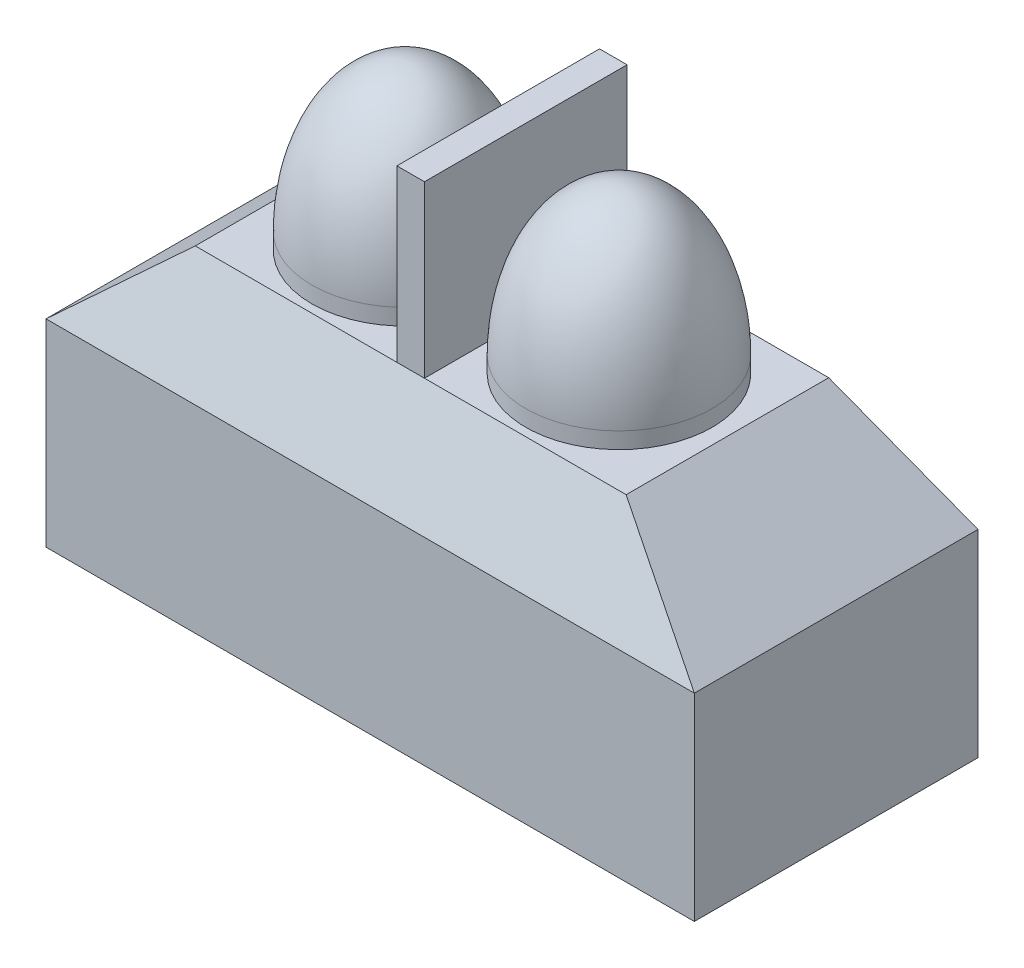
ISO-10303-21;
HEADER;
FILE_DESCRIPTION(('STEP AP214'),'2;1');
FILE_NAME('part.step','',(''),(''),'','','');
FILE_SCHEMA(('AUTOMOTIVE_DESIGN { 1 0 10303 214 1 1 1 1 }'));
ENDSEC;
DATA;
#1=APPLICATION_CONTEXT('core data for automotive mechanical design processes');
#2=APPLICATION_PROTOCOL_DEFINITION('international standard','automotive_design',2000,#1);
#3=PRODUCT_CONTEXT('',#1,'mechanical');
#4=PRODUCT('Part','Part','',(#3));
#5=PRODUCT_RELATED_PRODUCT_CATEGORY('part','',(#4));
#6=PRODUCT_DEFINITION_FORMATION('','',#4);
#7=PRODUCT_DEFINITION_CONTEXT('part definition',#1,'design');
#8=PRODUCT_DEFINITION('design','',#6,#7);
#9=PRODUCT_DEFINITION_SHAPE('','',#8);
#10=(LENGTH_UNIT() NAMED_UNIT(*) SI_UNIT(.MILLI.,.METRE.));
#11=(NAMED_UNIT(*) PLANE_ANGLE_UNIT() SI_UNIT($,.RADIAN.));
#12=(NAMED_UNIT(*) SI_UNIT($,.STERADIAN.) SOLID_ANGLE_UNIT());
#13=UNCERTAINTY_MEASURE_WITH_UNIT(LENGTH_MEASURE(1.E-05),#10,'distance_accuracy_value','');
#14=(GEOMETRIC_REPRESENTATION_CONTEXT(3) GLOBAL_UNCERTAINTY_ASSIGNED_CONTEXT((#13)) GLOBAL_UNIT_ASSIGNED_CONTEXT((#10,
#11,#12)) REPRESENTATION_CONTEXT('',''));
#15=CARTESIAN_POINT('',(0.,0.,0.));
#16=DIRECTION('',(0.,0.,1.));
#17=DIRECTION('',(1.,0.,0.));
#18=AXIS2_PLACEMENT_3D('',#15,#16,#17);
#19=CARTESIAN_POINT('',(1.6764,4.8768,0.));
#20=DIRECTION('',(0.,-1.,0.));
#21=DIRECTION('',(0.,0.,-1.));
#22=AXIS2_PLACEMENT_3D('',#19,#20,#21);
#23=CYLINDRICAL_SURFACE('',#22,1.4605);
#24=CARTESIAN_POINT('',(1.6764,4.8768,0.));
#25=DIRECTION('',(0.,1.,0.));
#26=DIRECTION('',(0.,0.,-1.));
#27=AXIS2_PLACEMENT_3D('',#24,#25,#26);
#28=CIRCLE('',#27,1.4605);
#29=CARTESIAN_POINT('',(1.6764,4.8768,-1.4605));
#30=VERTEX_POINT('',#29);
#31=EDGE_CURVE('E13',#30,#30,#28,.T.);
#32=ORIENTED_EDGE('',*,*,#31,.F.);
#33=EDGE_LOOP('',(#32));
#34=FACE_BOUND('',#33,.T.);
#35=CARTESIAN_POINT('',(1.6764,4.6228,0.));
#36=DIRECTION('',(0.,1.,0.));
#37=DIRECTION('',(0.,0.,-1.));
#38=AXIS2_PLACEMENT_3D('',#35,#36,#37);
#39=CIRCLE('',#38,1.4605);
#40=CARTESIAN_POINT('',(1.6764,4.6228,-1.4605));
#41=VERTEX_POINT('',#40);
#42=EDGE_CURVE('E53',#41,#41,#39,.T.);
#43=ORIENTED_EDGE('',*,*,#42,.T.);
#44=EDGE_LOOP('',(#43));
#45=FACE_BOUND('',#44,.T.);
#46=ADVANCED_FACE('F45',(#34,#45),#23,.T.);
#47=CARTESIAN_POINT('',(1.6764,4.8768,0.));
#48=DIRECTION('',(-1.,0.,0.));
#49=DIRECTION('',(0.,1.,0.));
#50=AXIS2_PLACEMENT_3D('',#47,#48,#49);
#51=ELLIPSE('',#50,2.286,1.4605);
#52=TRIMMED_CURVE('',#51,(PARAMETER_VALUE(0.)),(PARAMETER_VALUE(3.14159265358979)),.T.,.PARAMETER.);
#53=CARTESIAN_POINT('',(1.6764,2.5908,0.));
#54=DIRECTION('',(0.,1.,0.));
#55=AXIS1_PLACEMENT('',#53,#54);
#56=SURFACE_OF_REVOLUTION('',#52,#55);
#57=CARTESIAN_POINT('',(1.6764,7.1628,0.));
#58=VERTEX_POINT('',#57);
#59=VERTEX_LOOP('',#58);
#60=FACE_BOUND('',#59,.T.);
#61=ORIENTED_EDGE('',*,*,#31,.T.);
#62=EDGE_LOOP('',(#61));
#63=FACE_BOUND('',#62,.T.);
#64=ADVANCED_FACE('F47',(#60,#63),#56,.F.);
#65=CARTESIAN_POINT('',(1.6764,4.6228,0.));
#66=DIRECTION('',(0.,-1.,0.));
#67=DIRECTION('',(0.,0.,-1.));
#68=AXIS2_PLACEMENT_3D('',#65,#66,#67);
#69=PLANE('',#68);
#70=ORIENTED_EDGE('',*,*,#42,.F.);
#71=EDGE_LOOP('',(#70));
#72=FACE_BOUND('',#71,.T.);
#73=ADVANCED_FACE('F58',(#72),#69,.T.);
#74=CLOSED_SHELL('',(#46,#64,#73));
#75=MANIFOLD_SOLID_BREP('B2',#74);
#76=CARTESIAN_POINT('',(-1.6764,4.8768,0.));
#77=DIRECTION('',(0.,-1.,0.));
#78=DIRECTION('',(0.,0.,-1.));
#79=AXIS2_PLACEMENT_3D('',#76,#77,#78);
#80=CYLINDRICAL_SURFACE('',#79,1.4605);
#81=CARTESIAN_POINT('',(-1.6764,4.8768,0.));
#82=DIRECTION('',(0.,1.,0.));
#83=DIRECTION('',(0.,0.,1.));
#84=AXIS2_PLACEMENT_3D('',#81,#82,#83);
#85=CIRCLE('',#84,1.4605);
#86=CARTESIAN_POINT('',(-1.6764,4.8768,1.4605));
#87=VERTEX_POINT('',#86);
#88=EDGE_CURVE('E43',#87,#87,#85,.T.);
#89=ORIENTED_EDGE('',*,*,#88,.F.);
#90=EDGE_LOOP('',(#89));
#91=FACE_BOUND('',#90,.T.);
#92=CARTESIAN_POINT('',(-1.6764,4.6228,0.));
#93=DIRECTION('',(0.,1.,0.));
#94=DIRECTION('',(0.,0.,1.));
#95=AXIS2_PLACEMENT_3D('',#92,#93,#94);
#96=CIRCLE('',#95,1.4605);
#97=CARTESIAN_POINT('',(-1.6764,4.6228,1.4605));
#98=VERTEX_POINT('',#97);
#99=EDGE_CURVE('E107',#98,#98,#96,.T.);
#100=ORIENTED_EDGE('',*,*,#99,.T.);
#101=EDGE_LOOP('',(#100));
#102=FACE_BOUND('',#101,.T.);
#103=ADVANCED_FACE('F99',(#91,#102),#80,.T.);
#104=CARTESIAN_POINT('',(-1.6764,4.8768,0.));
#105=DIRECTION('',(1.,0.,0.));
#106=DIRECTION('',(0.,1.,0.));
#107=AXIS2_PLACEMENT_3D('',#104,#105,#106);
#108=ELLIPSE('',#107,2.286,1.4605);
#109=TRIMMED_CURVE('',#108,(PARAMETER_VALUE(0.)),(PARAMETER_VALUE(3.14159265358979)),.T.,.PARAMETER.);
#110=CARTESIAN_POINT('',(-1.6764,2.5908,0.));
#111=DIRECTION('',(0.,1.,0.));
#112=AXIS1_PLACEMENT('',#110,#111);
#113=SURFACE_OF_REVOLUTION('',#109,#112);
#114=CARTESIAN_POINT('',(-1.6764,7.1628,0.));
#115=VERTEX_POINT('',#114);
#116=VERTEX_LOOP('',#115);
#117=FACE_BOUND('',#116,.T.);
#118=ORIENTED_EDGE('',*,*,#88,.T.);
#119=EDGE_LOOP('',(#118));
#120=FACE_BOUND('',#119,.T.);
#121=ADVANCED_FACE('F101',(#117,#120),#113,.F.);
#122=CARTESIAN_POINT('',(-1.6764,4.6228,0.));
#123=DIRECTION('',(0.,1.,0.));
#124=DIRECTION('',(0.,0.,1.));
#125=AXIS2_PLACEMENT_3D('',#122,#123,#124);
#126=PLANE('',#125);
#127=ORIENTED_EDGE('',*,*,#99,.F.);
#128=EDGE_LOOP('',(#127));
#129=FACE_BOUND('',#128,.T.);
#130=ADVANCED_FACE('F112',(#129),#126,.F.);
#131=CLOSED_SHELL('',(#103,#121,#130));
#132=MANIFOLD_SOLID_BREP('B7',#131);
#133=CARTESIAN_POINT('',(5.08,4.6228,-2.2225));
#134=DIRECTION('',(0.,-1.,0.));
#135=DIRECTION('',(0.,0.,-1.));
#136=AXIS2_PLACEMENT_3D('',#133,#134,#135);
#137=PLANE('',#136);
#138=DIRECTION('',(0.,0.,-1.));
#139=VECTOR('',#138,1.);
#140=CARTESIAN_POINT('',(0.2159,4.6228,-1.5875));
#141=LINE('',#140,#139);
#142=CARTESIAN_POINT('',(0.215899999999996,4.6228,1.5875));
#143=VERTEX_POINT('',#142);
#144=CARTESIAN_POINT('',(0.215899999999996,4.6228,-1.5875));
#145=VERTEX_POINT('',#144);
#146=EDGE_CURVE('E248',#143,#145,#141,.T.);
#147=ORIENTED_EDGE('',*,*,#146,.F.);
#148=DIRECTION('',(1.,0.,0.));
#149=VECTOR('',#148,1.);
#150=CARTESIAN_POINT('',(-5.08000000000001,4.6228,1.5875));
#151=LINE('',#150,#149);
#152=CARTESIAN_POINT('',(3.37611620114516,4.6228,1.5875));
#153=VERTEX_POINT('',#152);
#154=EDGE_CURVE('E251',#143,#153,#151,.T.);
#155=ORIENTED_EDGE('',*,*,#154,.T.);
#156=DIRECTION('',(0.,0.,-1.));
#157=VECTOR('',#156,1.);
#158=CARTESIAN_POINT('',(3.37611620114517,4.6228,2.2225));
#159=LINE('',#158,#157);
#160=CARTESIAN_POINT('',(3.37611620114516,4.6228,-1.5875));
#161=VERTEX_POINT('',#160);
#162=EDGE_CURVE('E321',#153,#161,#159,.T.);
#163=ORIENTED_EDGE('',*,*,#162,.T.);
#164=DIRECTION('',(1.,0.,0.));
#165=VECTOR('',#164,1.);
#166=CARTESIAN_POINT('',(-5.08000000000001,4.6228,-1.5875));
#167=LINE('',#166,#165);
#168=EDGE_CURVE('E161',#145,#161,#167,.T.);
#169=ORIENTED_EDGE('',*,*,#168,.F.);
#170=EDGE_LOOP('',(#147,#155,#163,#169));
#171=FACE_BOUND('',#170,.T.);
#172=ADVANCED_FACE('F144',(#171),#137,.F.);
#173=DIRECTION('',(0.,0.,1.));
#174=VECTOR('',#173,1.);
#175=CARTESIAN_POINT('',(-0.2159,4.6228,-1.5875));
#176=LINE('',#175,#174);
#177=CARTESIAN_POINT('',(-0.215900000000003,4.6228,-1.5875));
#178=VERTEX_POINT('',#177);
#179=CARTESIAN_POINT('',(-0.2159,4.6228,1.5875));
#180=VERTEX_POINT('',#179);
#181=EDGE_CURVE('E169',#178,#180,#176,.T.);
#182=ORIENTED_EDGE('',*,*,#181,.F.);
#183=CARTESIAN_POINT('',(-3.37611620114517,4.6228,-1.5875));
#184=VERTEX_POINT('',#183);
#185=EDGE_CURVE('E304',#184,#178,#167,.T.);
#186=ORIENTED_EDGE('',*,*,#185,.F.);
#187=DIRECTION('',(0.,0.,-1.));
#188=VECTOR('',#187,1.);
#189=CARTESIAN_POINT('',(-3.37611620114517,4.6228,2.2225));
#190=LINE('',#189,#188);
#191=CARTESIAN_POINT('',(-3.37611620114517,4.6228,1.5875));
#192=VERTEX_POINT('',#191);
#193=EDGE_CURVE('E315',#192,#184,#190,.T.);
#194=ORIENTED_EDGE('',*,*,#193,.F.);
#195=EDGE_CURVE('E295',#192,#180,#151,.T.);
#196=ORIENTED_EDGE('',*,*,#195,.T.);
#197=EDGE_LOOP('',(#182,#186,#194,#196));
#198=FACE_BOUND('',#197,.T.);
#199=ADVANCED_FACE('F368',(#198),#137,.F.);
#200=CARTESIAN_POINT('',(-5.08,3.0988,-2.2225));
#201=DIRECTION('',(0.,0.,1.));
#202=DIRECTION('',(1.,0.,0.));
#203=AXIS2_PLACEMENT_3D('',#200,#201,#202);
#204=PLANE('',#203);
#205=DIRECTION('',(1.,0.,0.));
#206=VECTOR('',#205,1.);
#207=CARTESIAN_POINT('',(-5.08000000000001,3.0988,-2.2225));
#208=LINE('',#207,#206);
#209=CARTESIAN_POINT('',(-5.08,3.0988,-2.2225));
#210=VERTEX_POINT('',#209);
#211=CARTESIAN_POINT('',(5.08,3.0988,-2.2225));
#212=VERTEX_POINT('',#211);
#213=EDGE_CURVE('E310',#210,#212,#208,.T.);
#214=ORIENTED_EDGE('',*,*,#213,.T.);
#215=DIRECTION('',(0.,-1.,0.));
#216=VECTOR('',#215,1.);
#217=CARTESIAN_POINT('',(5.08,3.0988,-2.2225));
#218=LINE('',#217,#216);
#219=CARTESIAN_POINT('',(5.08,0.,-2.2225));
#220=VERTEX_POINT('',#219);
#221=EDGE_CURVE('E153',#212,#220,#218,.T.);
#222=ORIENTED_EDGE('',*,*,#221,.T.);
#223=DIRECTION('',(-1.,0.,0.));
#224=VECTOR('',#223,1.);
#225=CARTESIAN_POINT('',(-5.08,0.,-2.2225));
#226=LINE('',#225,#224);
#227=CARTESIAN_POINT('',(-5.08,0.,-2.2225));
#228=VERTEX_POINT('',#227);
#229=EDGE_CURVE('E328',#220,#228,#226,.T.);
#230=ORIENTED_EDGE('',*,*,#229,.T.);
#231=DIRECTION('',(0.,-1.,0.));
#232=VECTOR('',#231,1.);
#233=CARTESIAN_POINT('',(-5.08,3.0988,-2.2225));
#234=LINE('',#233,#232);
#235=EDGE_CURVE('E341',#210,#228,#234,.T.);
#236=ORIENTED_EDGE('',*,*,#235,.F.);
#237=EDGE_LOOP('',(#214,#222,#230,#236));
#238=FACE_BOUND('',#237,.T.);
#239=ADVANCED_FACE('F346',(#238),#204,.F.);
#240=CARTESIAN_POINT('',(3.37611620114517,4.6228,2.2225));
#241=DIRECTION('',(-0.666666666666667,-0.74535599249993,0.));
#242=DIRECTION('',(0.74535599249993,-0.666666666666667,0.));
#243=AXIS2_PLACEMENT_3D('',#240,#241,#242);
#244=PLANE('',#243);
#245=ORIENTED_EDGE('',*,*,#162,.F.);
#246=DIRECTION('',(0.718163847823682,-0.642345273086627,0.267643863786094));
#247=VECTOR('',#246,1.);
#248=CARTESIAN_POINT('',(3.49817091453018,4.51363094555874,1.63298710601719));
#249=LINE('',#248,#247);
#250=CARTESIAN_POINT('',(5.08,3.0988,2.2225));
#251=VERTEX_POINT('',#250);
#252=EDGE_CURVE('E299',#153,#251,#249,.T.);
#253=ORIENTED_EDGE('',*,*,#252,.T.);
#254=DIRECTION('',(0.,0.,-1.));
#255=VECTOR('',#254,1.);
#256=CARTESIAN_POINT('',(5.08,3.0988,2.2225));
#257=LINE('',#256,#255);
#258=EDGE_CURVE('E319',#251,#212,#257,.T.);
#259=ORIENTED_EDGE('',*,*,#258,.T.);
#260=DIRECTION('',(0.718163847823682,-0.642345273086627,-0.267643863786094));
#261=VECTOR('',#260,1.);
#262=CARTESIAN_POINT('',(2.64378792083506,5.27781432664756,-1.31457736389685));
#263=LINE('',#262,#261);
#264=EDGE_CURVE('E305',#161,#212,#263,.T.);
#265=ORIENTED_EDGE('',*,*,#264,.F.);
#266=EDGE_LOOP('',(#245,#253,#259,#265));
#267=FACE_BOUND('',#266,.T.);
#268=ADVANCED_FACE('F375',(#267),#244,.F.);
#269=CARTESIAN_POINT('',(-3.37611620114517,4.6228,2.2225));
#270=DIRECTION('',(0.666666666666667,-0.74535599249993,0.));
#271=DIRECTION('',(0.74535599249993,0.666666666666667,0.));
#272=AXIS2_PLACEMENT_3D('',#269,#270,#271);
#273=PLANE('',#272);
#274=DIRECTION('',(0.,0.,-1.));
#275=VECTOR('',#274,1.);
#276=CARTESIAN_POINT('',(-5.08,3.0988,2.2225));
#277=LINE('',#276,#275);
#278=CARTESIAN_POINT('',(-5.08,3.0988,2.2225));
#279=VERTEX_POINT('',#278);
#280=EDGE_CURVE('E316',#279,#210,#277,.T.);
#281=ORIENTED_EDGE('',*,*,#280,.F.);
#282=DIRECTION('',(0.718163847823682,0.642345273086627,-0.267643863786094));
#283=VECTOR('',#282,1.);
#284=CARTESIAN_POINT('',(-3.49817091453018,4.51363094555874,1.63298710601719));
#285=LINE('',#284,#283);
#286=EDGE_CURVE('E302',#279,#192,#285,.T.);
#287=ORIENTED_EDGE('',*,*,#286,.T.);
#288=ORIENTED_EDGE('',*,*,#193,.T.);
#289=DIRECTION('',(0.718163847823682,0.642345273086627,0.267643863786094));
#290=VECTOR('',#289,1.);
#291=CARTESIAN_POINT('',(-2.64378792083506,5.27781432664756,-1.31457736389685));
#292=LINE('',#291,#290);
#293=EDGE_CURVE('E97',#210,#184,#292,.T.);
#294=ORIENTED_EDGE('',*,*,#293,.F.);
#295=EDGE_LOOP('',(#281,#287,#288,#294));
#296=FACE_BOUND('',#295,.T.);
#297=ADVANCED_FACE('F365',(#296),#273,.F.);
#298=CARTESIAN_POINT('',(5.08,3.0988,2.2225));
#299=DIRECTION('',(-1.,0.,0.));
#300=DIRECTION('',(0.,0.,1.));
#301=AXIS2_PLACEMENT_3D('',#298,#299,#300);
#302=PLANE('',#301);
#303=ORIENTED_EDGE('',*,*,#221,.F.);
#304=ORIENTED_EDGE('',*,*,#258,.F.);
#305=DIRECTION('',(0.,-1.,0.));
#306=VECTOR('',#305,1.);
#307=CARTESIAN_POINT('',(5.08,3.0988,2.2225));
#308=LINE('',#307,#306);
#309=CARTESIAN_POINT('',(5.08,0.,2.2225));
#310=VERTEX_POINT('',#309);
#311=EDGE_CURVE('E337',#251,#310,#308,.T.);
#312=ORIENTED_EDGE('',*,*,#311,.T.);
#313=DIRECTION('',(0.,0.,-1.));
#314=VECTOR('',#313,1.);
#315=CARTESIAN_POINT('',(5.08,0.,2.2225));
#316=LINE('',#315,#314);
#317=EDGE_CURVE('E323',#310,#220,#316,.T.);
#318=ORIENTED_EDGE('',*,*,#317,.T.);
#319=EDGE_LOOP('',(#303,#304,#312,#318));
#320=FACE_BOUND('',#319,.T.);
#321=ADVANCED_FACE('F146',(#320),#302,.F.);
#322=CARTESIAN_POINT('',(-5.08,3.0988,2.2225));
#323=DIRECTION('',(1.,0.,0.));
#324=DIRECTION('',(0.,0.,-1.));
#325=AXIS2_PLACEMENT_3D('',#322,#323,#324);
#326=PLANE('',#325);
#327=DIRECTION('',(0.,-1.,0.));
#328=VECTOR('',#327,1.);
#329=CARTESIAN_POINT('',(-5.08,3.0988,2.2225));
#330=LINE('',#329,#328);
#331=CARTESIAN_POINT('',(-5.08,0.,2.2225));
#332=VERTEX_POINT('',#331);
#333=EDGE_CURVE('E339',#279,#332,#330,.T.);
#334=ORIENTED_EDGE('',*,*,#333,.F.);
#335=ORIENTED_EDGE('',*,*,#280,.T.);
#336=ORIENTED_EDGE('',*,*,#235,.T.);
#337=DIRECTION('',(0.,0.,1.));
#338=VECTOR('',#337,1.);
#339=CARTESIAN_POINT('',(-5.08,0.,2.2225));
#340=LINE('',#339,#338);
#341=EDGE_CURVE('E331',#228,#332,#340,.T.);
#342=ORIENTED_EDGE('',*,*,#341,.T.);
#343=EDGE_LOOP('',(#334,#335,#336,#342));
#344=FACE_BOUND('',#343,.T.);
#345=ADVANCED_FACE('F362',(#344),#326,.F.);
#346=CARTESIAN_POINT('',(-5.08,3.0988,2.2225));
#347=DIRECTION('',(0.,0.,-1.));
#348=DIRECTION('',(-1.,0.,0.));
#349=AXIS2_PLACEMENT_3D('',#346,#347,#348);
#350=PLANE('',#349);
#351=ORIENTED_EDGE('',*,*,#311,.F.);
#352=DIRECTION('',(1.,0.,0.));
#353=VECTOR('',#352,1.);
#354=CARTESIAN_POINT('',(-5.08000000000001,3.0988,2.2225));
#355=LINE('',#354,#353);
#356=EDGE_CURVE('E249',#279,#251,#355,.T.);
#357=ORIENTED_EDGE('',*,*,#356,.F.);
#358=ORIENTED_EDGE('',*,*,#333,.T.);
#359=DIRECTION('',(1.,0.,0.));
#360=VECTOR('',#359,1.);
#361=CARTESIAN_POINT('',(-5.08,0.,2.2225));
#362=LINE('',#361,#360);
#363=EDGE_CURVE('E334',#332,#310,#362,.T.);
#364=ORIENTED_EDGE('',*,*,#363,.T.);
#365=EDGE_LOOP('',(#351,#357,#358,#364));
#366=FACE_BOUND('',#365,.T.);
#367=ADVANCED_FACE('F358',(#366),#350,.F.);
#368=CARTESIAN_POINT('',(5.08,0.,-2.2225));
#369=DIRECTION('',(0.,-1.,0.));
#370=DIRECTION('',(0.,0.,-1.));
#371=AXIS2_PLACEMENT_3D('',#368,#369,#370);
#372=PLANE('',#371);
#373=ORIENTED_EDGE('',*,*,#317,.F.);
#374=ORIENTED_EDGE('',*,*,#363,.F.);
#375=ORIENTED_EDGE('',*,*,#341,.F.);
#376=ORIENTED_EDGE('',*,*,#229,.F.);
#377=EDGE_LOOP('',(#373,#374,#375,#376));
#378=FACE_BOUND('',#377,.T.);
#379=ADVANCED_FACE('F353',(#378),#372,.T.);
#380=CARTESIAN_POINT('',(-5.08000000000001,1.39574793268798,-2.93210502804667));
#381=DIRECTION('',(0.,0.384615384615384,-0.923076923076923));
#382=DIRECTION('',(0.,0.923076923076923,0.384615384615384));
#383=AXIS2_PLACEMENT_3D('',#380,#381,#382);
#384=PLANE('',#383);
#385=ORIENTED_EDGE('',*,*,#264,.T.);
#386=ORIENTED_EDGE('',*,*,#213,.F.);
#387=ORIENTED_EDGE('',*,*,#293,.T.);
#388=ORIENTED_EDGE('',*,*,#185,.T.);
#389=DIRECTION('',(-1.,0.,0.));
#390=VECTOR('',#389,1.);
#391=CARTESIAN_POINT('',(0.2159,4.6228,-1.5875));
#392=LINE('',#391,#390);
#393=EDGE_CURVE('E261',#145,#178,#392,.T.);
#394=ORIENTED_EDGE('',*,*,#393,.F.);
#395=ORIENTED_EDGE('',*,*,#168,.T.);
#396=EDGE_LOOP('',(#385,#386,#387,#388,#394,#395));
#397=FACE_BOUND('',#396,.T.);
#398=ADVANCED_FACE('F367',(#397),#384,.T.);
#399=CARTESIAN_POINT('',(-5.08000000000001,5.03811715606941,1.41445118497108));
#400=DIRECTION('',(0.,-0.384615384615384,-0.923076923076923));
#401=DIRECTION('',(0.,0.923076923076923,-0.384615384615384));
#402=AXIS2_PLACEMENT_3D('',#399,#400,#401);
#403=PLANE('',#402);
#404=ORIENTED_EDGE('',*,*,#195,.F.);
#405=ORIENTED_EDGE('',*,*,#286,.F.);
#406=ORIENTED_EDGE('',*,*,#356,.T.);
#407=ORIENTED_EDGE('',*,*,#252,.F.);
#408=ORIENTED_EDGE('',*,*,#154,.F.);
#409=DIRECTION('',(1.,0.,0.));
#410=VECTOR('',#409,1.);
#411=CARTESIAN_POINT('',(0.2159,4.6228,1.5875));
#412=LINE('',#411,#410);
#413=EDGE_CURVE('E245',#180,#143,#412,.T.);
#414=ORIENTED_EDGE('',*,*,#413,.F.);
#415=EDGE_LOOP('',(#404,#405,#406,#407,#408,#414));
#416=FACE_BOUND('',#415,.T.);
#417=ADVANCED_FACE('F294',(#416),#403,.F.);
#418=CARTESIAN_POINT('',(0.2159,7.2898,-1.5875));
#419=DIRECTION('',(-1.,0.,0.));
#420=DIRECTION('',(0.,0.,1.));
#421=AXIS2_PLACEMENT_3D('',#418,#419,#420);
#422=PLANE('',#421);
#423=ORIENTED_EDGE('',*,*,#146,.T.);
#424=DIRECTION('',(0.,-1.,0.));
#425=VECTOR('',#424,1.);
#426=CARTESIAN_POINT('',(0.2159,7.2898,-1.5875));
#427=LINE('',#426,#425);
#428=CARTESIAN_POINT('',(0.2159,7.2898,-1.5875));
#429=VERTEX_POINT('',#428);
#430=EDGE_CURVE('E229',#429,#145,#427,.T.);
#431=ORIENTED_EDGE('',*,*,#430,.F.);
#432=DIRECTION('',(0.,0.,-1.));
#433=VECTOR('',#432,1.);
#434=CARTESIAN_POINT('',(0.2159,7.2898,-1.5875));
#435=LINE('',#434,#433);
#436=CARTESIAN_POINT('',(0.2159,7.2898,1.5875));
#437=VERTEX_POINT('',#436);
#438=EDGE_CURVE('E236',#437,#429,#435,.T.);
#439=ORIENTED_EDGE('',*,*,#438,.F.);
#440=DIRECTION('',(0.,-1.,0.));
#441=VECTOR('',#440,1.);
#442=CARTESIAN_POINT('',(0.2159,7.2898,1.5875));
#443=LINE('',#442,#441);
#444=EDGE_CURVE('E262',#437,#143,#443,.T.);
#445=ORIENTED_EDGE('',*,*,#444,.T.);
#446=EDGE_LOOP('',(#423,#431,#439,#445));
#447=FACE_BOUND('',#446,.T.);
#448=ADVANCED_FACE('F247',(#447),#422,.F.);
#449=CARTESIAN_POINT('',(0.2159,7.2898,-1.5875));
#450=DIRECTION('',(0.,0.,1.));
#451=DIRECTION('',(1.,0.,0.));
#452=AXIS2_PLACEMENT_3D('',#449,#450,#451);
#453=PLANE('',#452);
#454=ORIENTED_EDGE('',*,*,#393,.T.);
#455=DIRECTION('',(0.,-1.,0.));
#456=VECTOR('',#455,1.);
#457=CARTESIAN_POINT('',(-0.2159,7.2898,-1.5875));
#458=LINE('',#457,#456);
#459=CARTESIAN_POINT('',(-0.2159,7.2898,-1.5875));
#460=VERTEX_POINT('',#459);
#461=EDGE_CURVE('E232',#460,#178,#458,.T.);
#462=ORIENTED_EDGE('',*,*,#461,.F.);
#463=DIRECTION('',(-1.,0.,0.));
#464=VECTOR('',#463,1.);
#465=CARTESIAN_POINT('',(0.2159,7.2898,-1.5875));
#466=LINE('',#465,#464);
#467=EDGE_CURVE('E224',#429,#460,#466,.T.);
#468=ORIENTED_EDGE('',*,*,#467,.F.);
#469=ORIENTED_EDGE('',*,*,#430,.T.);
#470=EDGE_LOOP('',(#454,#462,#468,#469));
#471=FACE_BOUND('',#470,.T.);
#472=ADVANCED_FACE('F227',(#471),#453,.F.);
#473=CARTESIAN_POINT('',(-0.2159,7.2898,-1.5875));
#474=DIRECTION('',(1.,0.,0.));
#475=DIRECTION('',(0.,0.,-1.));
#476=AXIS2_PLACEMENT_3D('',#473,#474,#475);
#477=PLANE('',#476);
#478=ORIENTED_EDGE('',*,*,#181,.T.);
#479=DIRECTION('',(0.,-1.,0.));
#480=VECTOR('',#479,1.);
#481=CARTESIAN_POINT('',(-0.2159,7.2898,1.5875));
#482=LINE('',#481,#480);
#483=CARTESIAN_POINT('',(-0.2159,7.2898,1.5875));
#484=VERTEX_POINT('',#483);
#485=EDGE_CURVE('E253',#484,#180,#482,.T.);
#486=ORIENTED_EDGE('',*,*,#485,.F.);
#487=DIRECTION('',(0.,0.,1.));
#488=VECTOR('',#487,1.);
#489=CARTESIAN_POINT('',(-0.2159,7.2898,-1.5875));
#490=LINE('',#489,#488);
#491=EDGE_CURVE('E235',#460,#484,#490,.T.);
#492=ORIENTED_EDGE('',*,*,#491,.F.);
#493=ORIENTED_EDGE('',*,*,#461,.T.);
#494=EDGE_LOOP('',(#478,#486,#492,#493));
#495=FACE_BOUND('',#494,.T.);
#496=ADVANCED_FACE('F287',(#495),#477,.F.);
#497=CARTESIAN_POINT('',(0.2159,7.2898,1.5875));
#498=DIRECTION('',(0.,0.,-1.));
#499=DIRECTION('',(-1.,0.,0.));
#500=AXIS2_PLACEMENT_3D('',#497,#498,#499);
#501=PLANE('',#500);
#502=ORIENTED_EDGE('',*,*,#413,.T.);
#503=ORIENTED_EDGE('',*,*,#444,.F.);
#504=DIRECTION('',(1.,0.,0.));
#505=VECTOR('',#504,1.);
#506=CARTESIAN_POINT('',(0.2159,7.2898,1.5875));
#507=LINE('',#506,#505);
#508=EDGE_CURVE('E241',#484,#437,#507,.T.);
#509=ORIENTED_EDGE('',*,*,#508,.F.);
#510=ORIENTED_EDGE('',*,*,#485,.T.);
#511=EDGE_LOOP('',(#502,#503,#509,#510));
#512=FACE_BOUND('',#511,.T.);
#513=ADVANCED_FACE('F290',(#512),#501,.F.);
#514=CARTESIAN_POINT('',(0.2159,7.2898,1.5875));
#515=DIRECTION('',(0.,-1.,0.));
#516=DIRECTION('',(0.,0.,-1.));
#517=AXIS2_PLACEMENT_3D('',#514,#515,#516);
#518=PLANE('',#517);
#519=ORIENTED_EDGE('',*,*,#438,.T.);
#520=ORIENTED_EDGE('',*,*,#467,.T.);
#521=ORIENTED_EDGE('',*,*,#491,.T.);
#522=ORIENTED_EDGE('',*,*,#508,.T.);
#523=EDGE_LOOP('',(#519,#520,#521,#522));
#524=FACE_BOUND('',#523,.T.);
#525=ADVANCED_FACE('F239',(#524),#518,.F.);
#526=CLOSED_SHELL('',(#172,#199,#239,#268,#297,#321,#345,#367,#379,#398,#417,#448,#472,#496,
#513,#525));
#527=MANIFOLD_SOLID_BREP('B37',#526);
#528=ADVANCED_BREP_SHAPE_REPRESENTATION('',(#18,#75,#132,#527),#14);
#529=SHAPE_DEFINITION_REPRESENTATION(#9,#528);
ENDSEC;
END-ISO-10303-21;
